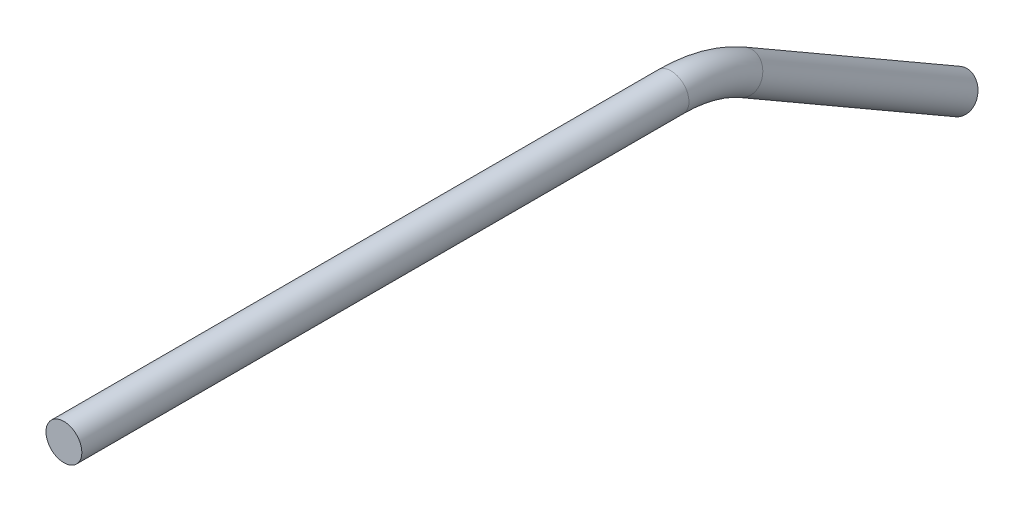
ISO-10303-21;
HEADER;
FILE_DESCRIPTION(('STEP AP214'),'2;1');
FILE_NAME('part.step','',(''),(''),'','','');
FILE_SCHEMA(('AUTOMOTIVE_DESIGN { 1 0 10303 214 1 1 1 1 }'));
ENDSEC;
DATA;
#1=APPLICATION_CONTEXT('core data for automotive mechanical design processes');
#2=APPLICATION_PROTOCOL_DEFINITION('international standard','automotive_design',2000,#1);
#3=PRODUCT_CONTEXT('',#1,'mechanical');
#4=PRODUCT('Part','Part','',(#3));
#5=PRODUCT_RELATED_PRODUCT_CATEGORY('part','',(#4));
#6=PRODUCT_DEFINITION_FORMATION('','',#4);
#7=PRODUCT_DEFINITION_CONTEXT('part definition',#1,'design');
#8=PRODUCT_DEFINITION('design','',#6,#7);
#9=PRODUCT_DEFINITION_SHAPE('','',#8);
#10=(LENGTH_UNIT() NAMED_UNIT(*) SI_UNIT(.MILLI.,.METRE.));
#11=(NAMED_UNIT(*) PLANE_ANGLE_UNIT() SI_UNIT($,.RADIAN.));
#12=(NAMED_UNIT(*) SI_UNIT($,.STERADIAN.) SOLID_ANGLE_UNIT());
#13=UNCERTAINTY_MEASURE_WITH_UNIT(LENGTH_MEASURE(1.E-05),#10,'distance_accuracy_value','');
#14=(GEOMETRIC_REPRESENTATION_CONTEXT(3) GLOBAL_UNCERTAINTY_ASSIGNED_CONTEXT((#13)) GLOBAL_UNIT_ASSIGNED_CONTEXT((#10,
#11,#12)) REPRESENTATION_CONTEXT('',''));
#15=CARTESIAN_POINT('',(0.,0.,0.));
#16=DIRECTION('',(0.,0.,1.));
#17=DIRECTION('',(1.,0.,0.));
#18=AXIS2_PLACEMENT_3D('',#15,#16,#17);
#19=CARTESIAN_POINT('',(0.,-3.40295474387527,-120.19409051225));
#20=DIRECTION('',(0.,-0.500000000000001,-0.866025403784438));
#21=DIRECTION('',(0.,0.866025403784438,-0.500000000000001));
#22=AXIS2_PLACEMENT_3D('',#19,#20,#21);
#23=CYLINDRICAL_SURFACE('',#22,3.175);
#24=CARTESIAN_POINT('',(0.,-3.40295474387527,-120.19409051225));
#25=DIRECTION('',(0.,0.500000000000001,0.866025403784438));
#26=DIRECTION('',(1.,0.,0.));
#27=AXIS2_PLACEMENT_3D('',#24,#25,#26);
#28=CIRCLE('',#27,3.175);
#29=CARTESIAN_POINT('',(0.,-0.653324086859686,-121.78159051225));
#30=VERTEX_POINT('',#29);
#31=EDGE_CURVE('E37',#30,#30,#28,.T.);
#32=ORIENTED_EDGE('',*,*,#31,.F.);
#33=EDGE_LOOP('',(#32));
#34=FACE_BOUND('',#33,.T.);
#35=CARTESIAN_POINT('',(0.,-25.4,-158.294090512249));
#36=DIRECTION('',(0.,0.500000000000001,0.866025403784438));
#37=DIRECTION('',(1.,0.,0.));
#38=AXIS2_PLACEMENT_3D('',#35,#36,#37);
#39=CIRCLE('',#38,3.175);
#40=CARTESIAN_POINT('',(3.175,-25.4,-158.294090512249));
#41=VERTEX_POINT('',#40);
#42=EDGE_CURVE('E10',#41,#41,#39,.T.);
#43=ORIENTED_EDGE('',*,*,#42,.T.);
#44=EDGE_LOOP('',(#43));
#45=FACE_BOUND('',#44,.T.);
#46=ADVANCED_FACE('F31',(#34,#45),#23,.T.);
#47=CARTESIAN_POINT('',(0.,-25.4,-107.494090512249));
#48=DIRECTION('',(-1.,0.,0.));
#49=DIRECTION('',(0.,0.,1.));
#50=AXIS2_PLACEMENT_3D('',#47,#48,#49);
#51=TOROIDAL_SURFACE('',#50,25.4,3.175);
#52=CARTESIAN_POINT('',(0.,0.,-107.494090512249));
#53=DIRECTION('',(0.,0.,1.));
#54=DIRECTION('',(1.,0.,0.));
#55=AXIS2_PLACEMENT_3D('',#52,#53,#54);
#56=CIRCLE('',#55,3.175);
#57=CARTESIAN_POINT('',(0.,3.175,-107.494090512249));
#58=VERTEX_POINT('',#57);
#59=EDGE_CURVE('E41',#58,#58,#56,.T.);
#60=CARTESIAN_POINT('',(0.,-25.4,-107.494090512249));
#61=DIRECTION('',(-1.,0.,0.));
#62=DIRECTION('',(0.,0.,1.));
#63=AXIS2_PLACEMENT_3D('',#60,#61,#62);
#64=CIRCLE('',#63,28.575);
#65=EDGE_CURVE('',#58,#30,#64,.T.);
#66=ORIENTED_EDGE('',*,*,#59,.F.);
#67=ORIENTED_EDGE('',*,*,#31,.T.);
#68=ORIENTED_EDGE('',*,*,#65,.T.);
#69=ORIENTED_EDGE('',*,*,#65,.F.);
#70=EDGE_LOOP('',(#66,#68,#67,#69));
#71=FACE_BOUND('',#70,.T.);
#72=ADVANCED_FACE('F56',(#71),#51,.T.);
#73=CARTESIAN_POINT('',(0.,0.,-107.494090512249));
#74=DIRECTION('',(0.,0.,1.));
#75=DIRECTION('',(1.,0.,0.));
#76=AXIS2_PLACEMENT_3D('',#73,#74,#75);
#77=CYLINDRICAL_SURFACE('',#76,3.175);
#78=ORIENTED_EDGE('',*,*,#59,.T.);
#79=EDGE_LOOP('',(#78));
#80=FACE_BOUND('',#79,.T.);
#81=CARTESIAN_POINT('',(0.,0.,0.));
#82=DIRECTION('',(0.,0.,1.));
#83=DIRECTION('',(1.,0.,0.));
#84=AXIS2_PLACEMENT_3D('',#81,#82,#83);
#85=CIRCLE('',#84,3.175);
#86=CARTESIAN_POINT('',(3.175,0.,0.));
#87=VERTEX_POINT('',#86);
#88=EDGE_CURVE('E45',#87,#87,#85,.T.);
#89=ORIENTED_EDGE('',*,*,#88,.F.);
#90=EDGE_LOOP('',(#89));
#91=FACE_BOUND('',#90,.T.);
#92=ADVANCED_FACE('F53',(#80,#91),#77,.T.);
#93=CARTESIAN_POINT('',(0.,-25.4,-158.294090512249));
#94=DIRECTION('',(0.,0.500000000000001,0.866025403784438));
#95=DIRECTION('',(1.,0.,0.));
#96=AXIS2_PLACEMENT_3D('',#93,#94,#95);
#97=PLANE('',#96);
#98=ORIENTED_EDGE('',*,*,#42,.F.);
#99=EDGE_LOOP('',(#98));
#100=FACE_BOUND('',#99,.T.);
#101=ADVANCED_FACE('F55',(#100),#97,.F.);
#102=CARTESIAN_POINT('',(0.,0.,0.));
#103=DIRECTION('',(0.,0.,1.));
#104=DIRECTION('',(1.,0.,0.));
#105=AXIS2_PLACEMENT_3D('',#102,#103,#104);
#106=PLANE('',#105);
#107=ORIENTED_EDGE('',*,*,#88,.T.);
#108=EDGE_LOOP('',(#107));
#109=FACE_BOUND('',#108,.T.);
#110=ADVANCED_FACE('F51',(#109),#106,.T.);
#111=CLOSED_SHELL('',(#46,#72,#92,#101,#110));
#112=MANIFOLD_SOLID_BREP('B2',#111);
#113=ADVANCED_BREP_SHAPE_REPRESENTATION('',(#18,#112),#14);
#114=SHAPE_DEFINITION_REPRESENTATION(#9,#113);
ENDSEC;
END-ISO-10303-21;
